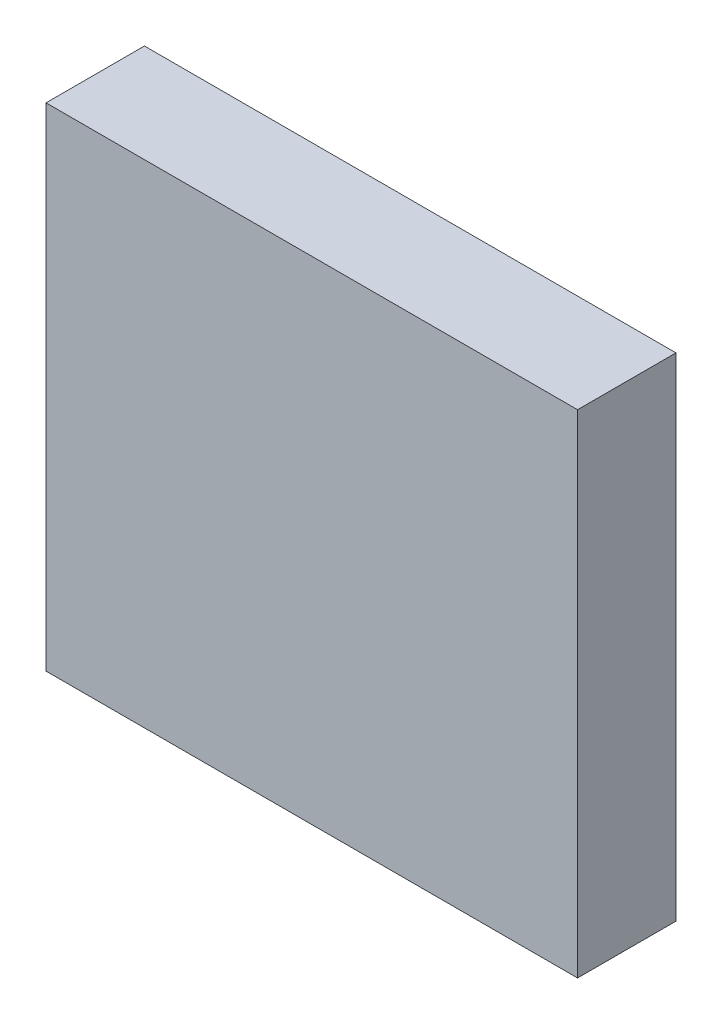
ISO-10303-21;
HEADER;
FILE_DESCRIPTION(('STEP AP214'),'2;1');
FILE_NAME('part.step','',(''),(''),'','','');
FILE_SCHEMA(('AUTOMOTIVE_DESIGN { 1 0 10303 214 1 1 1 1 }'));
ENDSEC;
DATA;
#1=APPLICATION_CONTEXT('core data for automotive mechanical design processes');
#2=APPLICATION_PROTOCOL_DEFINITION('international standard','automotive_design',2000,#1);
#3=PRODUCT_CONTEXT('',#1,'mechanical');
#4=PRODUCT('Part','Part','',(#3));
#5=PRODUCT_RELATED_PRODUCT_CATEGORY('part','',(#4));
#6=PRODUCT_DEFINITION_FORMATION('','',#4);
#7=PRODUCT_DEFINITION_CONTEXT('part definition',#1,'design');
#8=PRODUCT_DEFINITION('design','',#6,#7);
#9=PRODUCT_DEFINITION_SHAPE('','',#8);
#10=(LENGTH_UNIT() NAMED_UNIT(*) SI_UNIT(.MILLI.,.METRE.));
#11=(NAMED_UNIT(*) PLANE_ANGLE_UNIT() SI_UNIT($,.RADIAN.));
#12=(NAMED_UNIT(*) SI_UNIT($,.STERADIAN.) SOLID_ANGLE_UNIT());
#13=UNCERTAINTY_MEASURE_WITH_UNIT(LENGTH_MEASURE(1.E-05),#10,'distance_accuracy_value','');
#14=(GEOMETRIC_REPRESENTATION_CONTEXT(3) GLOBAL_UNCERTAINTY_ASSIGNED_CONTEXT((#13)) GLOBAL_UNIT_ASSIGNED_CONTEXT((#10,
#11,#12)) REPRESENTATION_CONTEXT('',''));
#15=CARTESIAN_POINT('',(0.,0.,0.));
#16=DIRECTION('',(0.,0.,1.));
#17=DIRECTION('',(1.,0.,0.));
#18=AXIS2_PLACEMENT_3D('',#15,#16,#17);
#19=CARTESIAN_POINT('',(135.,125.,50.));
#20=DIRECTION('',(-1.,0.,0.));
#21=DIRECTION('',(0.,-1.,0.));
#22=AXIS2_PLACEMENT_3D('',#19,#20,#21);
#23=PLANE('',#22);
#24=DIRECTION('',(0.,1.,0.));
#25=VECTOR('',#24,1.);
#26=CARTESIAN_POINT('',(135.,125.,0.));
#27=LINE('',#26,#25);
#28=CARTESIAN_POINT('',(135.,-125.,0.));
#29=VERTEX_POINT('',#28);
#30=CARTESIAN_POINT('',(135.,125.,0.));
#31=VERTEX_POINT('',#30);
#32=EDGE_CURVE('E100',#29,#31,#27,.T.);
#33=ORIENTED_EDGE('',*,*,#32,.T.);
#34=DIRECTION('',(0.,0.,-1.));
#35=VECTOR('',#34,1.);
#36=CARTESIAN_POINT('',(135.,125.,50.));
#37=LINE('',#36,#35);
#38=CARTESIAN_POINT('',(135.,125.,50.));
#39=VERTEX_POINT('',#38);
#40=EDGE_CURVE('E11',#39,#31,#37,.T.);
#41=ORIENTED_EDGE('',*,*,#40,.F.);
#42=DIRECTION('',(0.,1.,0.));
#43=VECTOR('',#42,1.);
#44=CARTESIAN_POINT('',(135.,125.,50.));
#45=LINE('',#44,#43);
#46=CARTESIAN_POINT('',(135.,-125.,50.));
#47=VERTEX_POINT('',#46);
#48=EDGE_CURVE('E88',#47,#39,#45,.T.);
#49=ORIENTED_EDGE('',*,*,#48,.F.);
#50=DIRECTION('',(0.,0.,-1.));
#51=VECTOR('',#50,1.);
#52=CARTESIAN_POINT('',(135.,-125.,50.));
#53=LINE('',#52,#51);
#54=EDGE_CURVE('E96',#47,#29,#53,.T.);
#55=ORIENTED_EDGE('',*,*,#54,.T.);
#56=EDGE_LOOP('',(#33,#41,#49,#55));
#57=FACE_BOUND('',#56,.T.);
#58=ADVANCED_FACE('F37',(#57),#23,.F.);
#59=CARTESIAN_POINT('',(-135.,125.,50.));
#60=DIRECTION('',(0.,-1.,0.));
#61=DIRECTION('',(0.,0.,-1.));
#62=AXIS2_PLACEMENT_3D('',#59,#60,#61);
#63=PLANE('',#62);
#64=DIRECTION('',(-1.,0.,0.));
#65=VECTOR('',#64,1.);
#66=CARTESIAN_POINT('',(-135.,125.,0.));
#67=LINE('',#66,#65);
#68=CARTESIAN_POINT('',(-135.,125.,0.));
#69=VERTEX_POINT('',#68);
#70=EDGE_CURVE('E92',#31,#69,#67,.T.);
#71=ORIENTED_EDGE('',*,*,#70,.T.);
#72=DIRECTION('',(0.,0.,-1.));
#73=VECTOR('',#72,1.);
#74=CARTESIAN_POINT('',(-135.,125.,50.));
#75=LINE('',#74,#73);
#76=CARTESIAN_POINT('',(-135.,125.,50.));
#77=VERTEX_POINT('',#76);
#78=EDGE_CURVE('E45',#77,#69,#75,.T.);
#79=ORIENTED_EDGE('',*,*,#78,.F.);
#80=DIRECTION('',(-1.,0.,0.));
#81=VECTOR('',#80,1.);
#82=CARTESIAN_POINT('',(-135.,125.,50.));
#83=LINE('',#82,#81);
#84=EDGE_CURVE('E83',#39,#77,#83,.T.);
#85=ORIENTED_EDGE('',*,*,#84,.F.);
#86=ORIENTED_EDGE('',*,*,#40,.T.);
#87=EDGE_LOOP('',(#71,#79,#85,#86));
#88=FACE_BOUND('',#87,.T.);
#89=ADVANCED_FACE('F91',(#88),#63,.F.);
#90=CARTESIAN_POINT('',(-135.,125.,50.));
#91=DIRECTION('',(1.,0.,0.));
#92=DIRECTION('',(0.,1.,0.));
#93=AXIS2_PLACEMENT_3D('',#90,#91,#92);
#94=PLANE('',#93);
#95=DIRECTION('',(0.,-1.,0.));
#96=VECTOR('',#95,1.);
#97=CARTESIAN_POINT('',(-135.,125.,0.));
#98=LINE('',#97,#96);
#99=CARTESIAN_POINT('',(-135.,-125.,0.));
#100=VERTEX_POINT('',#99);
#101=EDGE_CURVE('E70',#69,#100,#98,.T.);
#102=ORIENTED_EDGE('',*,*,#101,.T.);
#103=DIRECTION('',(0.,0.,-1.));
#104=VECTOR('',#103,1.);
#105=CARTESIAN_POINT('',(-135.,-125.,50.));
#106=LINE('',#105,#104);
#107=CARTESIAN_POINT('',(-135.,-125.,50.));
#108=VERTEX_POINT('',#107);
#109=EDGE_CURVE('E93',#108,#100,#106,.T.);
#110=ORIENTED_EDGE('',*,*,#109,.F.);
#111=DIRECTION('',(0.,-1.,0.));
#112=VECTOR('',#111,1.);
#113=CARTESIAN_POINT('',(-135.,125.,50.));
#114=LINE('',#113,#112);
#115=EDGE_CURVE('E86',#77,#108,#114,.T.);
#116=ORIENTED_EDGE('',*,*,#115,.F.);
#117=ORIENTED_EDGE('',*,*,#78,.T.);
#118=EDGE_LOOP('',(#102,#110,#116,#117));
#119=FACE_BOUND('',#118,.T.);
#120=ADVANCED_FACE('F94',(#119),#94,.F.);
#121=CARTESIAN_POINT('',(-135.,-125.,50.));
#122=DIRECTION('',(0.,1.,0.));
#123=DIRECTION('',(0.,0.,1.));
#124=AXIS2_PLACEMENT_3D('',#121,#122,#123);
#125=PLANE('',#124);
#126=DIRECTION('',(1.,0.,0.));
#127=VECTOR('',#126,1.);
#128=CARTESIAN_POINT('',(-135.,-125.,0.));
#129=LINE('',#128,#127);
#130=EDGE_CURVE('E76',#100,#29,#129,.T.);
#131=ORIENTED_EDGE('',*,*,#130,.T.);
#132=ORIENTED_EDGE('',*,*,#54,.F.);
#133=DIRECTION('',(1.,0.,0.));
#134=VECTOR('',#133,1.);
#135=CARTESIAN_POINT('',(-135.,-125.,50.));
#136=LINE('',#135,#134);
#137=EDGE_CURVE('E53',#108,#47,#136,.T.);
#138=ORIENTED_EDGE('',*,*,#137,.F.);
#139=ORIENTED_EDGE('',*,*,#109,.T.);
#140=EDGE_LOOP('',(#131,#132,#138,#139));
#141=FACE_BOUND('',#140,.T.);
#142=ADVANCED_FACE('F107',(#141),#125,.F.);
#143=CARTESIAN_POINT('',(0.,0.,50.));
#144=DIRECTION('',(0.,0.,1.));
#145=DIRECTION('',(1.,0.,0.));
#146=AXIS2_PLACEMENT_3D('',#143,#144,#145);
#147=PLANE('',#146);
#148=ORIENTED_EDGE('',*,*,#48,.T.);
#149=ORIENTED_EDGE('',*,*,#84,.T.);
#150=ORIENTED_EDGE('',*,*,#115,.T.);
#151=ORIENTED_EDGE('',*,*,#137,.T.);
#152=EDGE_LOOP('',(#148,#149,#150,#151));
#153=FACE_BOUND('',#152,.T.);
#154=ADVANCED_FACE('F84',(#153),#147,.T.);
#155=CARTESIAN_POINT('',(0.,0.,0.));
#156=DIRECTION('',(0.,0.,1.));
#157=DIRECTION('',(1.,0.,0.));
#158=AXIS2_PLACEMENT_3D('',#155,#156,#157);
#159=PLANE('',#158);
#160=ORIENTED_EDGE('',*,*,#32,.F.);
#161=ORIENTED_EDGE('',*,*,#130,.F.);
#162=ORIENTED_EDGE('',*,*,#101,.F.);
#163=ORIENTED_EDGE('',*,*,#70,.F.);
#164=EDGE_LOOP('',(#160,#161,#162,#163));
#165=FACE_BOUND('',#164,.T.);
#166=ADVANCED_FACE('F110',(#165),#159,.F.);
#167=CLOSED_SHELL('',(#58,#89,#120,#142,#154,#166));
#168=MANIFOLD_SOLID_BREP('B2',#167);
#169=ADVANCED_BREP_SHAPE_REPRESENTATION('',(#18,#168),#14);
#170=SHAPE_DEFINITION_REPRESENTATION(#9,#169);
ENDSEC;
END-ISO-10303-21;
